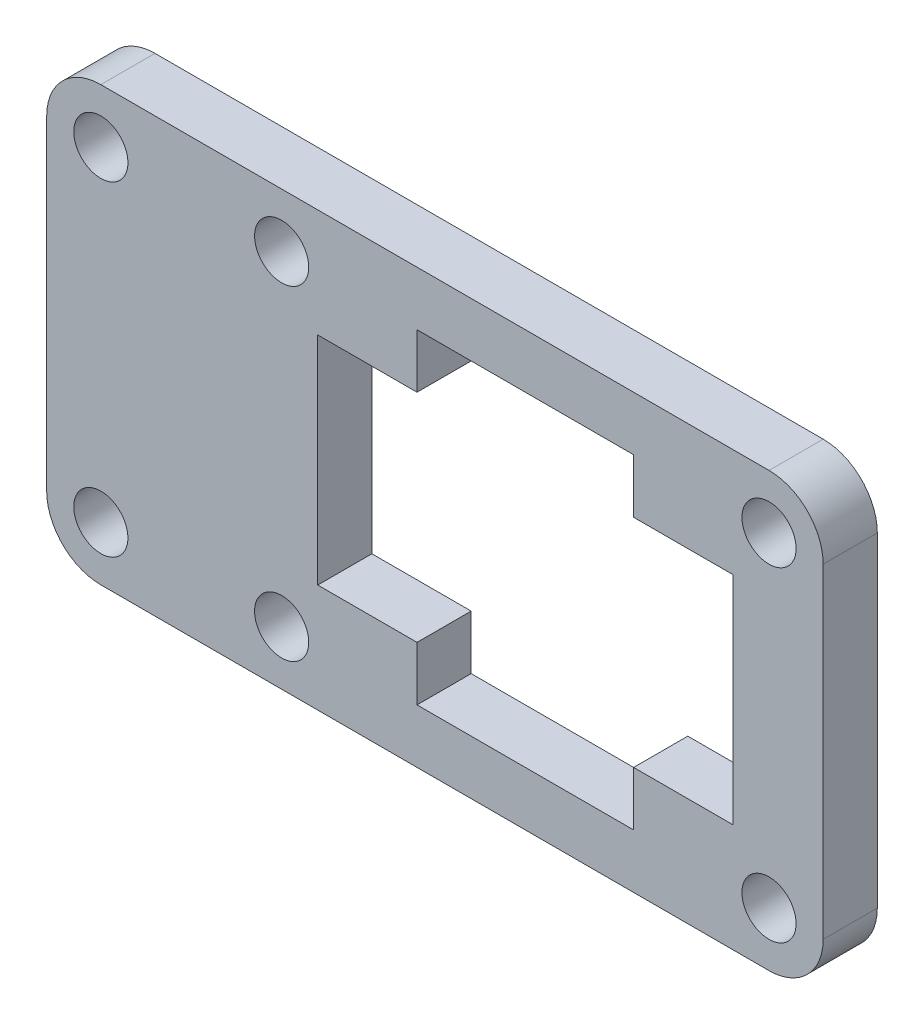
ISO-10303-21;
HEADER;
FILE_DESCRIPTION(('STEP AP214'),'2;1');
FILE_NAME('part.step','',(''),(''),'','','');
FILE_SCHEMA(('AUTOMOTIVE_DESIGN { 1 0 10303 214 1 1 1 1 }'));
ENDSEC;
DATA;
#1=APPLICATION_CONTEXT('core data for automotive mechanical design processes');
#2=APPLICATION_PROTOCOL_DEFINITION('international standard','automotive_design',2000,#1);
#3=PRODUCT_CONTEXT('',#1,'mechanical');
#4=PRODUCT('Part','Part','',(#3));
#5=PRODUCT_RELATED_PRODUCT_CATEGORY('part','',(#4));
#6=PRODUCT_DEFINITION_FORMATION('','',#4);
#7=PRODUCT_DEFINITION_CONTEXT('part definition',#1,'design');
#8=PRODUCT_DEFINITION('design','',#6,#7);
#9=PRODUCT_DEFINITION_SHAPE('','',#8);
#10=(LENGTH_UNIT() NAMED_UNIT(*) SI_UNIT(.MILLI.,.METRE.));
#11=(NAMED_UNIT(*) PLANE_ANGLE_UNIT() SI_UNIT($,.RADIAN.));
#12=(NAMED_UNIT(*) SI_UNIT($,.STERADIAN.) SOLID_ANGLE_UNIT());
#13=UNCERTAINTY_MEASURE_WITH_UNIT(LENGTH_MEASURE(1.E-05),#10,'distance_accuracy_value','');
#14=(GEOMETRIC_REPRESENTATION_CONTEXT(3) GLOBAL_UNCERTAINTY_ASSIGNED_CONTEXT((#13)) GLOBAL_UNIT_ASSIGNED_CONTEXT((#10,
#11,#12)) REPRESENTATION_CONTEXT('',''));
#15=CARTESIAN_POINT('',(0.,0.,0.));
#16=DIRECTION('',(0.,0.,1.));
#17=DIRECTION('',(1.,0.,0.));
#18=AXIS2_PLACEMENT_3D('',#15,#16,#17);
#19=CARTESIAN_POINT('',(63.748376395524,-38.3124718985925,3.));
#20=DIRECTION('',(0.,0.,-1.));
#21=DIRECTION('',(-1.,0.,0.));
#22=AXIS2_PLACEMENT_3D('',#19,#20,#21);
#23=PLANE('',#22);
#24=CARTESIAN_POINT('',(36.748376395524,-38.3124718985925,3.));
#25=DIRECTION('',(0.,0.,1.));
#26=DIRECTION('',(1.,0.,0.));
#27=AXIS2_PLACEMENT_3D('',#24,#25,#26);
#28=CIRCLE('',#27,1.5);
#29=CARTESIAN_POINT('',(38.248376395524,-38.3124718985925,3.));
#30=VERTEX_POINT('',#29);
#31=EDGE_CURVE('E469',#30,#30,#28,.T.);
#32=ORIENTED_EDGE('',*,*,#31,.F.);
#33=EDGE_LOOP('',(#32));
#34=FACE_BOUND('',#33,.T.);
#35=CARTESIAN_POINT('',(63.748376395524,-56.3124718985925,3.));
#36=DIRECTION('',(0.,0.,1.));
#37=DIRECTION('',(1.,0.,0.));
#38=AXIS2_PLACEMENT_3D('',#35,#36,#37);
#39=CIRCLE('',#38,1.5);
#40=CARTESIAN_POINT('',(65.248376395524,-56.3124718985925,3.));
#41=VERTEX_POINT('',#40);
#42=EDGE_CURVE('E481',#41,#41,#39,.T.);
#43=ORIENTED_EDGE('',*,*,#42,.F.);
#44=EDGE_LOOP('',(#43));
#45=FACE_BOUND('',#44,.T.);
#46=CARTESIAN_POINT('',(26.7321907696324,-38.3124718985925,3.));
#47=DIRECTION('',(0.,0.,1.));
#48=DIRECTION('',(1.,0.,0.));
#49=AXIS2_PLACEMENT_3D('',#46,#47,#48);
#50=CIRCLE('',#49,1.5);
#51=CARTESIAN_POINT('',(28.2321907696324,-38.3124718985925,3.));
#52=VERTEX_POINT('',#51);
#53=EDGE_CURVE('E220',#52,#52,#50,.T.);
#54=ORIENTED_EDGE('',*,*,#53,.F.);
#55=EDGE_LOOP('',(#54));
#56=FACE_BOUND('',#55,.T.);
#57=CARTESIAN_POINT('',(63.748376395524,-38.3124718985925,3.));
#58=DIRECTION('',(0.,0.,1.));
#59=DIRECTION('',(-1.,0.,0.));
#60=AXIS2_PLACEMENT_3D('',#57,#58,#59);
#61=CIRCLE('',#60,3.);
#62=CARTESIAN_POINT('',(66.748376395524,-38.3124718985925,3.));
#63=VERTEX_POINT('',#62);
#64=CARTESIAN_POINT('',(63.748376395524,-35.3124718985925,3.));
#65=VERTEX_POINT('',#64);
#66=EDGE_CURVE('E270',#63,#65,#61,.T.);
#67=ORIENTED_EDGE('',*,*,#66,.T.);
#68=DIRECTION('',(-1.,0.,0.));
#69=VECTOR('',#68,1.);
#70=CARTESIAN_POINT('',(26.7321907696324,-35.3124718985925,3.));
#71=LINE('',#70,#69);
#72=CARTESIAN_POINT('',(26.7321907696324,-35.3124718985925,3.));
#73=VERTEX_POINT('',#72);
#74=EDGE_CURVE('E273',#65,#73,#71,.T.);
#75=ORIENTED_EDGE('',*,*,#74,.T.);
#76=CARTESIAN_POINT('',(26.7321907696324,-38.3124718985925,3.));
#77=DIRECTION('',(0.,0.,1.));
#78=DIRECTION('',(1.,0.,0.));
#79=AXIS2_PLACEMENT_3D('',#76,#77,#78);
#80=CIRCLE('',#79,3.);
#81=CARTESIAN_POINT('',(23.7321907696324,-38.3124718985925,3.));
#82=VERTEX_POINT('',#81);
#83=EDGE_CURVE('E276',#73,#82,#80,.T.);
#84=ORIENTED_EDGE('',*,*,#83,.T.);
#85=DIRECTION('',(0.,-1.,0.));
#86=VECTOR('',#85,1.);
#87=CARTESIAN_POINT('',(23.7321907696324,-38.3124718985925,3.));
#88=LINE('',#87,#86);
#89=CARTESIAN_POINT('',(23.7321907696324,-56.3124718985925,3.));
#90=VERTEX_POINT('',#89);
#91=EDGE_CURVE('E278',#82,#90,#88,.T.);
#92=ORIENTED_EDGE('',*,*,#91,.T.);
#93=CARTESIAN_POINT('',(26.7321907696324,-56.3124718985925,3.));
#94=DIRECTION('',(0.,0.,1.));
#95=DIRECTION('',(1.,0.,0.));
#96=AXIS2_PLACEMENT_3D('',#93,#94,#95);
#97=CIRCLE('',#96,3.);
#98=CARTESIAN_POINT('',(26.7321907696324,-59.3124718985925,3.));
#99=VERTEX_POINT('',#98);
#100=EDGE_CURVE('E280',#90,#99,#97,.T.);
#101=ORIENTED_EDGE('',*,*,#100,.T.);
#102=DIRECTION('',(1.,0.,0.));
#103=VECTOR('',#102,1.);
#104=CARTESIAN_POINT('',(26.7321907696324,-59.3124718985925,3.));
#105=LINE('',#104,#103);
#106=CARTESIAN_POINT('',(63.748376395524,-59.3124718985925,3.));
#107=VERTEX_POINT('',#106);
#108=EDGE_CURVE('E282',#99,#107,#105,.T.);
#109=ORIENTED_EDGE('',*,*,#108,.T.);
#110=CARTESIAN_POINT('',(63.748376395524,-56.3124718985925,3.));
#111=DIRECTION('',(0.,0.,1.));
#112=DIRECTION('',(1.,0.,0.));
#113=AXIS2_PLACEMENT_3D('',#110,#111,#112);
#114=CIRCLE('',#113,3.);
#115=CARTESIAN_POINT('',(66.748376395524,-56.3124718985925,3.));
#116=VERTEX_POINT('',#115);
#117=EDGE_CURVE('E284',#107,#116,#114,.T.);
#118=ORIENTED_EDGE('',*,*,#117,.T.);
#119=DIRECTION('',(0.,1.,0.));
#120=VECTOR('',#119,1.);
#121=CARTESIAN_POINT('',(66.748376395524,-38.3124718985925,3.));
#122=LINE('',#121,#120);
#123=EDGE_CURVE('E286',#116,#63,#122,.T.);
#124=ORIENTED_EDGE('',*,*,#123,.T.);
#125=EDGE_LOOP('',(#67,#75,#84,#92,#101,#109,#118,#124));
#126=FACE_BOUND('',#125,.T.);
#127=DIRECTION('',(0.,-1.,0.));
#128=VECTOR('',#127,1.);
#129=CARTESIAN_POINT('',(38.748376395524,-53.3124718985925,3.));
#130=LINE('',#129,#128);
#131=CARTESIAN_POINT('',(38.748376395524,-41.3124718985925,3.));
#132=VERTEX_POINT('',#131);
#133=CARTESIAN_POINT('',(38.748376395524,-53.3124718985925,3.));
#134=VERTEX_POINT('',#133);
#135=EDGE_CURVE('E174',#132,#134,#130,.T.);
#136=ORIENTED_EDGE('',*,*,#135,.F.);
#137=DIRECTION('',(-1.,0.,0.));
#138=VECTOR('',#137,1.);
#139=CARTESIAN_POINT('',(38.748376395524,-41.3124718985925,3.));
#140=LINE('',#139,#138);
#141=CARTESIAN_POINT('',(44.248376395524,-41.3124718985925,3.));
#142=VERTEX_POINT('',#141);
#143=EDGE_CURVE('E217',#142,#132,#140,.T.);
#144=ORIENTED_EDGE('',*,*,#143,.F.);
#145=DIRECTION('',(0.,-1.,0.));
#146=VECTOR('',#145,1.);
#147=CARTESIAN_POINT('',(44.248376395524,-41.3124718985925,3.));
#148=LINE('',#147,#146);
#149=CARTESIAN_POINT('',(44.248376395524,-38.3124718985925,3.));
#150=VERTEX_POINT('',#149);
#151=EDGE_CURVE('E215',#150,#142,#148,.T.);
#152=ORIENTED_EDGE('',*,*,#151,.F.);
#153=DIRECTION('',(-1.,0.,0.));
#154=VECTOR('',#153,1.);
#155=CARTESIAN_POINT('',(56.248376395524,-38.3124718985925,3.));
#156=LINE('',#155,#154);
#157=CARTESIAN_POINT('',(56.248376395524,-38.3124718985925,3.));
#158=VERTEX_POINT('',#157);
#159=EDGE_CURVE('E213',#158,#150,#156,.T.);
#160=ORIENTED_EDGE('',*,*,#159,.F.);
#161=DIRECTION('',(0.,1.,0.));
#162=VECTOR('',#161,1.);
#163=CARTESIAN_POINT('',(56.248376395524,-41.3124718985925,3.));
#164=LINE('',#163,#162);
#165=CARTESIAN_POINT('',(56.248376395524,-41.3124718985925,3.));
#166=VERTEX_POINT('',#165);
#167=EDGE_CURVE('E211',#166,#158,#164,.T.);
#168=ORIENTED_EDGE('',*,*,#167,.F.);
#169=DIRECTION('',(-1.,0.,0.));
#170=VECTOR('',#169,1.);
#171=CARTESIAN_POINT('',(56.248376395524,-41.3124718985925,3.));
#172=LINE('',#171,#170);
#173=CARTESIAN_POINT('',(61.748376395524,-41.3124718985925,3.));
#174=VERTEX_POINT('',#173);
#175=EDGE_CURVE('E209',#174,#166,#172,.T.);
#176=ORIENTED_EDGE('',*,*,#175,.F.);
#177=DIRECTION('',(0.,1.,0.));
#178=VECTOR('',#177,1.);
#179=CARTESIAN_POINT('',(61.748376395524,-53.3124718985925,3.));
#180=LINE('',#179,#178);
#181=CARTESIAN_POINT('',(61.748376395524,-53.3124718985925,3.));
#182=VERTEX_POINT('',#181);
#183=EDGE_CURVE('E207',#182,#174,#180,.T.);
#184=ORIENTED_EDGE('',*,*,#183,.F.);
#185=DIRECTION('',(1.,0.,0.));
#186=VECTOR('',#185,1.);
#187=CARTESIAN_POINT('',(56.248376395524,-53.3124718985925,3.));
#188=LINE('',#187,#186);
#189=CARTESIAN_POINT('',(56.248376395524,-53.3124718985925,3.));
#190=VERTEX_POINT('',#189);
#191=EDGE_CURVE('E205',#190,#182,#188,.T.);
#192=ORIENTED_EDGE('',*,*,#191,.F.);
#193=DIRECTION('',(0.,1.,0.));
#194=VECTOR('',#193,1.);
#195=CARTESIAN_POINT('',(56.248376395524,-56.3124718985925,3.));
#196=LINE('',#195,#194);
#197=CARTESIAN_POINT('',(56.248376395524,-56.3124718985925,3.));
#198=VERTEX_POINT('',#197);
#199=EDGE_CURVE('E203',#198,#190,#196,.T.);
#200=ORIENTED_EDGE('',*,*,#199,.F.);
#201=DIRECTION('',(1.,0.,0.));
#202=VECTOR('',#201,1.);
#203=CARTESIAN_POINT('',(56.248376395524,-56.3124718985925,3.));
#204=LINE('',#203,#202);
#205=CARTESIAN_POINT('',(44.248376395524,-56.3124718985925,3.));
#206=VERTEX_POINT('',#205);
#207=EDGE_CURVE('E198',#206,#198,#204,.T.);
#208=ORIENTED_EDGE('',*,*,#207,.F.);
#209=DIRECTION('',(0.,-1.,0.));
#210=VECTOR('',#209,1.);
#211=CARTESIAN_POINT('',(44.248376395524,-56.3124718985925,3.));
#212=LINE('',#211,#210);
#213=CARTESIAN_POINT('',(44.248376395524,-53.3124718985925,3.));
#214=VERTEX_POINT('',#213);
#215=EDGE_CURVE('E196',#214,#206,#212,.T.);
#216=ORIENTED_EDGE('',*,*,#215,.F.);
#217=DIRECTION('',(1.,0.,0.));
#218=VECTOR('',#217,1.);
#219=CARTESIAN_POINT('',(38.748376395524,-53.3124718985925,3.));
#220=LINE('',#219,#218);
#221=EDGE_CURVE('E182',#134,#214,#220,.T.);
#222=ORIENTED_EDGE('',*,*,#221,.F.);
#223=EDGE_LOOP('',(#136,#144,#152,#160,#168,#176,#184,#192,#200,#208,#216,#222));
#224=FACE_BOUND('',#223,.T.);
#225=CARTESIAN_POINT('',(63.748376395524,-38.3124718985925,3.));
#226=DIRECTION('',(0.,0.,1.));
#227=DIRECTION('',(1.,0.,0.));
#228=AXIS2_PLACEMENT_3D('',#225,#226,#227);
#229=CIRCLE('',#228,1.5);
#230=CARTESIAN_POINT('',(65.248376395524,-38.3124718985925,3.));
#231=VERTEX_POINT('',#230);
#232=EDGE_CURVE('E487',#231,#231,#229,.T.);
#233=ORIENTED_EDGE('',*,*,#232,.F.);
#234=EDGE_LOOP('',(#233));
#235=FACE_BOUND('',#234,.T.);
#236=CARTESIAN_POINT('',(26.7321907696324,-56.3124718985925,3.));
#237=DIRECTION('',(0.,0.,1.));
#238=DIRECTION('',(1.,0.,0.));
#239=AXIS2_PLACEMENT_3D('',#236,#237,#238);
#240=CIRCLE('',#239,1.5);
#241=CARTESIAN_POINT('',(28.2321907696324,-56.3124718985925,3.));
#242=VERTEX_POINT('',#241);
#243=EDGE_CURVE('E475',#242,#242,#240,.T.);
#244=ORIENTED_EDGE('',*,*,#243,.F.);
#245=EDGE_LOOP('',(#244));
#246=FACE_BOUND('',#245,.T.);
#247=CARTESIAN_POINT('',(36.748376395524,-56.3124718985925,3.));
#248=DIRECTION('',(0.,0.,1.));
#249=DIRECTION('',(1.,0.,0.));
#250=AXIS2_PLACEMENT_3D('',#247,#248,#249);
#251=CIRCLE('',#250,1.5);
#252=CARTESIAN_POINT('',(38.248376395524,-56.3124718985925,3.));
#253=VERTEX_POINT('',#252);
#254=EDGE_CURVE('E460',#253,#253,#251,.T.);
#255=ORIENTED_EDGE('',*,*,#254,.F.);
#256=EDGE_LOOP('',(#255));
#257=FACE_BOUND('',#256,.T.);
#258=ADVANCED_FACE('F37',(#34,#45,#56,#126,#224,#235,#246,#257),#23,.F.);
#259=CARTESIAN_POINT('',(63.748376395524,-38.3124718985925,0.));
#260=DIRECTION('',(0.,0.,-1.));
#261=DIRECTION('',(-1.,0.,0.));
#262=AXIS2_PLACEMENT_3D('',#259,#260,#261);
#263=PLANE('',#262);
#264=CARTESIAN_POINT('',(36.748376395524,-38.3124718985925,0.));
#265=DIRECTION('',(0.,0.,1.));
#266=DIRECTION('',(1.,0.,0.));
#267=AXIS2_PLACEMENT_3D('',#264,#265,#266);
#268=CIRCLE('',#267,1.5);
#269=CARTESIAN_POINT('',(38.248376395524,-38.3124718985925,0.));
#270=VERTEX_POINT('',#269);
#271=EDGE_CURVE('E466',#270,#270,#268,.T.);
#272=ORIENTED_EDGE('',*,*,#271,.T.);
#273=EDGE_LOOP('',(#272));
#274=FACE_BOUND('',#273,.T.);
#275=CARTESIAN_POINT('',(63.748376395524,-56.3124718985925,0.));
#276=DIRECTION('',(0.,0.,1.));
#277=DIRECTION('',(1.,0.,0.));
#278=AXIS2_PLACEMENT_3D('',#275,#276,#277);
#279=CIRCLE('',#278,1.5);
#280=CARTESIAN_POINT('',(65.248376395524,-56.3124718985925,0.));
#281=VERTEX_POINT('',#280);
#282=EDGE_CURVE('E478',#281,#281,#279,.T.);
#283=ORIENTED_EDGE('',*,*,#282,.T.);
#284=EDGE_LOOP('',(#283));
#285=FACE_BOUND('',#284,.T.);
#286=CARTESIAN_POINT('',(26.7321907696324,-38.3124718985925,0.));
#287=DIRECTION('',(0.,0.,1.));
#288=DIRECTION('',(1.,0.,0.));
#289=AXIS2_PLACEMENT_3D('',#286,#287,#288);
#290=CIRCLE('',#289,1.5);
#291=CARTESIAN_POINT('',(28.2321907696324,-38.3124718985925,0.));
#292=VERTEX_POINT('',#291);
#293=EDGE_CURVE('E490',#292,#292,#290,.T.);
#294=ORIENTED_EDGE('',*,*,#293,.T.);
#295=EDGE_LOOP('',(#294));
#296=FACE_BOUND('',#295,.T.);
#297=CARTESIAN_POINT('',(63.748376395524,-38.3124718985925,0.));
#298=DIRECTION('',(0.,0.,1.));
#299=DIRECTION('',(-1.,0.,0.));
#300=AXIS2_PLACEMENT_3D('',#297,#298,#299);
#301=CIRCLE('',#300,3.);
#302=CARTESIAN_POINT('',(66.748376395524,-38.3124718985925,0.));
#303=VERTEX_POINT('',#302);
#304=CARTESIAN_POINT('',(63.748376395524,-35.3124718985925,0.));
#305=VERTEX_POINT('',#304);
#306=EDGE_CURVE('E190',#303,#305,#301,.T.);
#307=ORIENTED_EDGE('',*,*,#306,.F.);
#308=DIRECTION('',(0.,1.,0.));
#309=VECTOR('',#308,1.);
#310=CARTESIAN_POINT('',(66.748376395524,-38.3124718985925,0.));
#311=LINE('',#310,#309);
#312=CARTESIAN_POINT('',(66.748376395524,-56.3124718985925,0.));
#313=VERTEX_POINT('',#312);
#314=EDGE_CURVE('E274',#313,#303,#311,.T.);
#315=ORIENTED_EDGE('',*,*,#314,.F.);
#316=CARTESIAN_POINT('',(63.748376395524,-56.3124718985925,0.));
#317=DIRECTION('',(0.,0.,1.));
#318=DIRECTION('',(1.,0.,0.));
#319=AXIS2_PLACEMENT_3D('',#316,#317,#318);
#320=CIRCLE('',#319,3.);
#321=CARTESIAN_POINT('',(63.748376395524,-59.3124718985925,0.));
#322=VERTEX_POINT('',#321);
#323=EDGE_CURVE('E301',#322,#313,#320,.T.);
#324=ORIENTED_EDGE('',*,*,#323,.F.);
#325=DIRECTION('',(1.,0.,0.));
#326=VECTOR('',#325,1.);
#327=CARTESIAN_POINT('',(26.7321907696324,-59.3124718985925,0.));
#328=LINE('',#327,#326);
#329=CARTESIAN_POINT('',(26.7321907696324,-59.3124718985925,0.));
#330=VERTEX_POINT('',#329);
#331=EDGE_CURVE('E299',#330,#322,#328,.T.);
#332=ORIENTED_EDGE('',*,*,#331,.F.);
#333=CARTESIAN_POINT('',(26.7321907696324,-56.3124718985925,0.));
#334=DIRECTION('',(0.,0.,1.));
#335=DIRECTION('',(1.,0.,0.));
#336=AXIS2_PLACEMENT_3D('',#333,#334,#335);
#337=CIRCLE('',#336,3.);
#338=CARTESIAN_POINT('',(23.7321907696324,-56.3124718985925,0.));
#339=VERTEX_POINT('',#338);
#340=EDGE_CURVE('E297',#339,#330,#337,.T.);
#341=ORIENTED_EDGE('',*,*,#340,.F.);
#342=DIRECTION('',(0.,-1.,0.));
#343=VECTOR('',#342,1.);
#344=CARTESIAN_POINT('',(23.7321907696324,-38.3124718985925,0.));
#345=LINE('',#344,#343);
#346=CARTESIAN_POINT('',(23.7321907696324,-38.3124718985925,0.));
#347=VERTEX_POINT('',#346);
#348=EDGE_CURVE('E295',#347,#339,#345,.T.);
#349=ORIENTED_EDGE('',*,*,#348,.F.);
#350=CARTESIAN_POINT('',(26.7321907696324,-38.3124718985925,0.));
#351=DIRECTION('',(0.,0.,1.));
#352=DIRECTION('',(1.,0.,0.));
#353=AXIS2_PLACEMENT_3D('',#350,#351,#352);
#354=CIRCLE('',#353,3.);
#355=CARTESIAN_POINT('',(26.7321907696324,-35.3124718985925,0.));
#356=VERTEX_POINT('',#355);
#357=EDGE_CURVE('E293',#356,#347,#354,.T.);
#358=ORIENTED_EDGE('',*,*,#357,.F.);
#359=DIRECTION('',(-1.,0.,0.));
#360=VECTOR('',#359,1.);
#361=CARTESIAN_POINT('',(26.7321907696324,-35.3124718985925,0.));
#362=LINE('',#361,#360);
#363=EDGE_CURVE('E291',#305,#356,#362,.T.);
#364=ORIENTED_EDGE('',*,*,#363,.F.);
#365=EDGE_LOOP('',(#307,#315,#324,#332,#341,#349,#358,#364));
#366=FACE_BOUND('',#365,.T.);
#367=DIRECTION('',(-1.,0.,0.));
#368=VECTOR('',#367,1.);
#369=CARTESIAN_POINT('',(38.748376395524,-41.3124718985925,0.));
#370=LINE('',#369,#368);
#371=CARTESIAN_POINT('',(44.248376395524,-41.3124718985925,0.));
#372=VERTEX_POINT('',#371);
#373=CARTESIAN_POINT('',(38.748376395524,-41.3124718985925,0.));
#374=VERTEX_POINT('',#373);
#375=EDGE_CURVE('E183',#372,#374,#370,.T.);
#376=ORIENTED_EDGE('',*,*,#375,.T.);
#377=DIRECTION('',(0.,-1.,0.));
#378=VECTOR('',#377,1.);
#379=CARTESIAN_POINT('',(38.748376395524,-53.3124718985925,0.));
#380=LINE('',#379,#378);
#381=CARTESIAN_POINT('',(38.748376395524,-53.3124718985925,0.));
#382=VERTEX_POINT('',#381);
#383=EDGE_CURVE('E60',#374,#382,#380,.T.);
#384=ORIENTED_EDGE('',*,*,#383,.T.);
#385=DIRECTION('',(1.,0.,0.));
#386=VECTOR('',#385,1.);
#387=CARTESIAN_POINT('',(38.748376395524,-53.3124718985925,0.));
#388=LINE('',#387,#386);
#389=CARTESIAN_POINT('',(44.248376395524,-53.3124718985925,0.));
#390=VERTEX_POINT('',#389);
#391=EDGE_CURVE('E189',#382,#390,#388,.T.);
#392=ORIENTED_EDGE('',*,*,#391,.T.);
#393=DIRECTION('',(0.,-1.,0.));
#394=VECTOR('',#393,1.);
#395=CARTESIAN_POINT('',(44.248376395524,-56.3124718985925,0.));
#396=LINE('',#395,#394);
#397=CARTESIAN_POINT('',(44.248376395524,-56.3124718985925,0.));
#398=VERTEX_POINT('',#397);
#399=EDGE_CURVE('E222',#390,#398,#396,.T.);
#400=ORIENTED_EDGE('',*,*,#399,.T.);
#401=DIRECTION('',(1.,0.,0.));
#402=VECTOR('',#401,1.);
#403=CARTESIAN_POINT('',(56.248376395524,-56.3124718985925,0.));
#404=LINE('',#403,#402);
#405=CARTESIAN_POINT('',(56.248376395524,-56.3124718985925,0.));
#406=VERTEX_POINT('',#405);
#407=EDGE_CURVE('E225',#398,#406,#404,.T.);
#408=ORIENTED_EDGE('',*,*,#407,.T.);
#409=DIRECTION('',(0.,1.,0.));
#410=VECTOR('',#409,1.);
#411=CARTESIAN_POINT('',(56.248376395524,-56.3124718985925,0.));
#412=LINE('',#411,#410);
#413=CARTESIAN_POINT('',(56.248376395524,-53.3124718985925,0.));
#414=VERTEX_POINT('',#413);
#415=EDGE_CURVE('E228',#406,#414,#412,.T.);
#416=ORIENTED_EDGE('',*,*,#415,.T.);
#417=DIRECTION('',(1.,0.,0.));
#418=VECTOR('',#417,1.);
#419=CARTESIAN_POINT('',(56.248376395524,-53.3124718985925,0.));
#420=LINE('',#419,#418);
#421=CARTESIAN_POINT('',(61.748376395524,-53.3124718985925,0.));
#422=VERTEX_POINT('',#421);
#423=EDGE_CURVE('E231',#414,#422,#420,.T.);
#424=ORIENTED_EDGE('',*,*,#423,.T.);
#425=DIRECTION('',(0.,1.,0.));
#426=VECTOR('',#425,1.);
#427=CARTESIAN_POINT('',(61.748376395524,-53.3124718985925,0.));
#428=LINE('',#427,#426);
#429=CARTESIAN_POINT('',(61.748376395524,-41.3124718985925,0.));
#430=VERTEX_POINT('',#429);
#431=EDGE_CURVE('E234',#422,#430,#428,.T.);
#432=ORIENTED_EDGE('',*,*,#431,.T.);
#433=DIRECTION('',(-1.,0.,0.));
#434=VECTOR('',#433,1.);
#435=CARTESIAN_POINT('',(56.248376395524,-41.3124718985925,0.));
#436=LINE('',#435,#434);
#437=CARTESIAN_POINT('',(56.248376395524,-41.3124718985925,0.));
#438=VERTEX_POINT('',#437);
#439=EDGE_CURVE('E237',#430,#438,#436,.T.);
#440=ORIENTED_EDGE('',*,*,#439,.T.);
#441=DIRECTION('',(0.,1.,0.));
#442=VECTOR('',#441,1.);
#443=CARTESIAN_POINT('',(56.248376395524,-41.3124718985925,0.));
#444=LINE('',#443,#442);
#445=CARTESIAN_POINT('',(56.248376395524,-38.3124718985925,0.));
#446=VERTEX_POINT('',#445);
#447=EDGE_CURVE('E240',#438,#446,#444,.T.);
#448=ORIENTED_EDGE('',*,*,#447,.T.);
#449=DIRECTION('',(-1.,0.,0.));
#450=VECTOR('',#449,1.);
#451=CARTESIAN_POINT('',(56.248376395524,-38.3124718985925,0.));
#452=LINE('',#451,#450);
#453=CARTESIAN_POINT('',(44.248376395524,-38.3124718985925,0.));
#454=VERTEX_POINT('',#453);
#455=EDGE_CURVE('E243',#446,#454,#452,.T.);
#456=ORIENTED_EDGE('',*,*,#455,.T.);
#457=DIRECTION('',(0.,-1.,0.));
#458=VECTOR('',#457,1.);
#459=CARTESIAN_POINT('',(44.248376395524,-41.3124718985925,0.));
#460=LINE('',#459,#458);
#461=EDGE_CURVE('E246',#454,#372,#460,.T.);
#462=ORIENTED_EDGE('',*,*,#461,.T.);
#463=EDGE_LOOP('',(#376,#384,#392,#400,#408,#416,#424,#432,#440,#448,#456,#462));
#464=FACE_BOUND('',#463,.T.);
#465=CARTESIAN_POINT('',(63.748376395524,-38.3124718985925,0.));
#466=DIRECTION('',(0.,0.,1.));
#467=DIRECTION('',(1.,0.,0.));
#468=AXIS2_PLACEMENT_3D('',#465,#466,#467);
#469=CIRCLE('',#468,1.5);
#470=CARTESIAN_POINT('',(65.248376395524,-38.3124718985925,0.));
#471=VERTEX_POINT('',#470);
#472=EDGE_CURVE('E484',#471,#471,#469,.T.);
#473=ORIENTED_EDGE('',*,*,#472,.T.);
#474=EDGE_LOOP('',(#473));
#475=FACE_BOUND('',#474,.T.);
#476=CARTESIAN_POINT('',(26.7321907696324,-56.3124718985925,0.));
#477=DIRECTION('',(0.,0.,1.));
#478=DIRECTION('',(1.,0.,0.));
#479=AXIS2_PLACEMENT_3D('',#476,#477,#478);
#480=CIRCLE('',#479,1.5);
#481=CARTESIAN_POINT('',(28.2321907696324,-56.3124718985925,0.));
#482=VERTEX_POINT('',#481);
#483=EDGE_CURVE('E472',#482,#482,#480,.T.);
#484=ORIENTED_EDGE('',*,*,#483,.T.);
#485=EDGE_LOOP('',(#484));
#486=FACE_BOUND('',#485,.T.);
#487=CARTESIAN_POINT('',(36.748376395524,-56.3124718985925,0.));
#488=DIRECTION('',(0.,0.,1.));
#489=DIRECTION('',(1.,0.,0.));
#490=AXIS2_PLACEMENT_3D('',#487,#488,#489);
#491=CIRCLE('',#490,1.5);
#492=CARTESIAN_POINT('',(38.248376395524,-56.3124718985925,0.));
#493=VERTEX_POINT('',#492);
#494=EDGE_CURVE('E463',#493,#493,#491,.T.);
#495=ORIENTED_EDGE('',*,*,#494,.T.);
#496=EDGE_LOOP('',(#495));
#497=FACE_BOUND('',#496,.T.);
#498=ADVANCED_FACE('F331',(#274,#285,#296,#366,#464,#475,#486,#497),#263,.T.);
#499=CARTESIAN_POINT('',(63.748376395524,-38.3124718985925,3.));
#500=DIRECTION('',(0.,0.,-1.));
#501=DIRECTION('',(-1.,0.,0.));
#502=AXIS2_PLACEMENT_3D('',#499,#500,#501);
#503=CYLINDRICAL_SURFACE('',#502,3.);
#504=ORIENTED_EDGE('',*,*,#306,.T.);
#505=DIRECTION('',(0.,0.,-1.));
#506=VECTOR('',#505,1.);
#507=CARTESIAN_POINT('',(63.748376395524,-35.3124718985925,3.));
#508=LINE('',#507,#506);
#509=EDGE_CURVE('E11',#65,#305,#508,.T.);
#510=ORIENTED_EDGE('',*,*,#509,.F.);
#511=ORIENTED_EDGE('',*,*,#66,.F.);
#512=DIRECTION('',(0.,0.,-1.));
#513=VECTOR('',#512,1.);
#514=CARTESIAN_POINT('',(66.748376395524,-38.3124718985925,3.));
#515=LINE('',#514,#513);
#516=EDGE_CURVE('E288',#63,#303,#515,.T.);
#517=ORIENTED_EDGE('',*,*,#516,.T.);
#518=EDGE_LOOP('',(#504,#510,#511,#517));
#519=FACE_BOUND('',#518,.T.);
#520=ADVANCED_FACE('F39',(#519),#503,.T.);
#521=CARTESIAN_POINT('',(26.7321907696324,-35.3124718985925,3.));
#522=DIRECTION('',(0.,-1.,0.));
#523=DIRECTION('',(0.,0.,-1.));
#524=AXIS2_PLACEMENT_3D('',#521,#522,#523);
#525=PLANE('',#524);
#526=ORIENTED_EDGE('',*,*,#363,.T.);
#527=DIRECTION('',(0.,0.,-1.));
#528=VECTOR('',#527,1.);
#529=CARTESIAN_POINT('',(26.7321907696324,-35.3124718985925,3.));
#530=LINE('',#529,#528);
#531=EDGE_CURVE('E45',#73,#356,#530,.T.);
#532=ORIENTED_EDGE('',*,*,#531,.F.);
#533=ORIENTED_EDGE('',*,*,#74,.F.);
#534=ORIENTED_EDGE('',*,*,#509,.T.);
#535=EDGE_LOOP('',(#526,#532,#533,#534));
#536=FACE_BOUND('',#535,.T.);
#537=ADVANCED_FACE('F348',(#536),#525,.F.);
#538=CARTESIAN_POINT('',(26.7321907696324,-38.3124718985925,3.));
#539=DIRECTION('',(0.,0.,-1.));
#540=DIRECTION('',(-1.,0.,0.));
#541=AXIS2_PLACEMENT_3D('',#538,#539,#540);
#542=CYLINDRICAL_SURFACE('',#541,3.);
#543=ORIENTED_EDGE('',*,*,#357,.T.);
#544=DIRECTION('',(0.,0.,-1.));
#545=VECTOR('',#544,1.);
#546=CARTESIAN_POINT('',(23.7321907696324,-38.3124718985925,3.));
#547=LINE('',#546,#545);
#548=EDGE_CURVE('E318',#82,#347,#547,.T.);
#549=ORIENTED_EDGE('',*,*,#548,.F.);
#550=ORIENTED_EDGE('',*,*,#83,.F.);
#551=ORIENTED_EDGE('',*,*,#531,.T.);
#552=EDGE_LOOP('',(#543,#549,#550,#551));
#553=FACE_BOUND('',#552,.T.);
#554=ADVANCED_FACE('F325',(#553),#542,.T.);
#555=CARTESIAN_POINT('',(23.7321907696324,-38.3124718985925,3.));
#556=DIRECTION('',(1.,0.,0.));
#557=DIRECTION('',(0.,1.,0.));
#558=AXIS2_PLACEMENT_3D('',#555,#556,#557);
#559=PLANE('',#558);
#560=ORIENTED_EDGE('',*,*,#348,.T.);
#561=DIRECTION('',(0.,0.,-1.));
#562=VECTOR('',#561,1.);
#563=CARTESIAN_POINT('',(23.7321907696324,-56.3124718985925,3.));
#564=LINE('',#563,#562);
#565=EDGE_CURVE('E315',#90,#339,#564,.T.);
#566=ORIENTED_EDGE('',*,*,#565,.F.);
#567=ORIENTED_EDGE('',*,*,#91,.F.);
#568=ORIENTED_EDGE('',*,*,#548,.T.);
#569=EDGE_LOOP('',(#560,#566,#567,#568));
#570=FACE_BOUND('',#569,.T.);
#571=ADVANCED_FACE('F337',(#570),#559,.F.);
#572=CARTESIAN_POINT('',(26.7321907696324,-56.3124718985925,3.));
#573=DIRECTION('',(0.,0.,-1.));
#574=DIRECTION('',(-1.,0.,0.));
#575=AXIS2_PLACEMENT_3D('',#572,#573,#574);
#576=CYLINDRICAL_SURFACE('',#575,3.);
#577=ORIENTED_EDGE('',*,*,#340,.T.);
#578=DIRECTION('',(0.,0.,-1.));
#579=VECTOR('',#578,1.);
#580=CARTESIAN_POINT('',(26.7321907696324,-59.3124718985925,3.));
#581=LINE('',#580,#579);
#582=EDGE_CURVE('E312',#99,#330,#581,.T.);
#583=ORIENTED_EDGE('',*,*,#582,.F.);
#584=ORIENTED_EDGE('',*,*,#100,.F.);
#585=ORIENTED_EDGE('',*,*,#565,.T.);
#586=EDGE_LOOP('',(#577,#583,#584,#585));
#587=FACE_BOUND('',#586,.T.);
#588=ADVANCED_FACE('F341',(#587),#576,.T.);
#589=CARTESIAN_POINT('',(26.7321907696324,-59.3124718985925,3.));
#590=DIRECTION('',(0.,1.,0.));
#591=DIRECTION('',(0.,0.,1.));
#592=AXIS2_PLACEMENT_3D('',#589,#590,#591);
#593=PLANE('',#592);
#594=ORIENTED_EDGE('',*,*,#331,.T.);
#595=DIRECTION('',(0.,0.,-1.));
#596=VECTOR('',#595,1.);
#597=CARTESIAN_POINT('',(63.748376395524,-59.3124718985925,3.));
#598=LINE('',#597,#596);
#599=EDGE_CURVE('E309',#107,#322,#598,.T.);
#600=ORIENTED_EDGE('',*,*,#599,.F.);
#601=ORIENTED_EDGE('',*,*,#108,.F.);
#602=ORIENTED_EDGE('',*,*,#582,.T.);
#603=EDGE_LOOP('',(#594,#600,#601,#602));
#604=FACE_BOUND('',#603,.T.);
#605=ADVANCED_FACE('F361',(#604),#593,.F.);
#606=CARTESIAN_POINT('',(63.748376395524,-56.3124718985925,3.));
#607=DIRECTION('',(0.,0.,-1.));
#608=DIRECTION('',(-1.,0.,0.));
#609=AXIS2_PLACEMENT_3D('',#606,#607,#608);
#610=CYLINDRICAL_SURFACE('',#609,3.);
#611=ORIENTED_EDGE('',*,*,#323,.T.);
#612=DIRECTION('',(0.,0.,-1.));
#613=VECTOR('',#612,1.);
#614=CARTESIAN_POINT('',(66.748376395524,-56.3124718985925,3.));
#615=LINE('',#614,#613);
#616=EDGE_CURVE('E306',#116,#313,#615,.T.);
#617=ORIENTED_EDGE('',*,*,#616,.F.);
#618=ORIENTED_EDGE('',*,*,#117,.F.);
#619=ORIENTED_EDGE('',*,*,#599,.T.);
#620=EDGE_LOOP('',(#611,#617,#618,#619));
#621=FACE_BOUND('',#620,.T.);
#622=ADVANCED_FACE('F359',(#621),#610,.T.);
#623=CARTESIAN_POINT('',(66.748376395524,-38.3124718985925,3.));
#624=DIRECTION('',(-1.,0.,0.));
#625=DIRECTION('',(0.,-1.,0.));
#626=AXIS2_PLACEMENT_3D('',#623,#624,#625);
#627=PLANE('',#626);
#628=ORIENTED_EDGE('',*,*,#314,.T.);
#629=ORIENTED_EDGE('',*,*,#516,.F.);
#630=ORIENTED_EDGE('',*,*,#123,.F.);
#631=ORIENTED_EDGE('',*,*,#616,.T.);
#632=EDGE_LOOP('',(#628,#629,#630,#631));
#633=FACE_BOUND('',#632,.T.);
#634=ADVANCED_FACE('F354',(#633),#627,.F.);
#635=CARTESIAN_POINT('',(38.748376395524,-53.3124718985925,3.));
#636=DIRECTION('',(1.,0.,0.));
#637=DIRECTION('',(0.,1.,0.));
#638=AXIS2_PLACEMENT_3D('',#635,#636,#637);
#639=PLANE('',#638);
#640=ORIENTED_EDGE('',*,*,#383,.F.);
#641=DIRECTION('',(0.,0.,-1.));
#642=VECTOR('',#641,1.);
#643=CARTESIAN_POINT('',(38.748376395524,-41.3124718985925,3.));
#644=LINE('',#643,#642);
#645=EDGE_CURVE('E178',#132,#374,#644,.T.);
#646=ORIENTED_EDGE('',*,*,#645,.F.);
#647=ORIENTED_EDGE('',*,*,#135,.T.);
#648=DIRECTION('',(0.,0.,-1.));
#649=VECTOR('',#648,1.);
#650=CARTESIAN_POINT('',(38.748376395524,-53.3124718985925,3.));
#651=LINE('',#650,#649);
#652=EDGE_CURVE('E177',#134,#382,#651,.T.);
#653=ORIENTED_EDGE('',*,*,#652,.T.);
#654=EDGE_LOOP('',(#640,#646,#647,#653));
#655=FACE_BOUND('',#654,.T.);
#656=ADVANCED_FACE('F176',(#655),#639,.T.);
#657=CARTESIAN_POINT('',(38.748376395524,-53.3124718985925,3.));
#658=DIRECTION('',(0.,1.,0.));
#659=DIRECTION('',(0.,0.,1.));
#660=AXIS2_PLACEMENT_3D('',#657,#658,#659);
#661=PLANE('',#660);
#662=ORIENTED_EDGE('',*,*,#391,.F.);
#663=ORIENTED_EDGE('',*,*,#652,.F.);
#664=ORIENTED_EDGE('',*,*,#221,.T.);
#665=DIRECTION('',(0.,0.,-1.));
#666=VECTOR('',#665,1.);
#667=CARTESIAN_POINT('',(44.248376395524,-53.3124718985925,3.));
#668=LINE('',#667,#666);
#669=EDGE_CURVE('E191',#214,#390,#668,.T.);
#670=ORIENTED_EDGE('',*,*,#669,.T.);
#671=EDGE_LOOP('',(#662,#663,#664,#670));
#672=FACE_BOUND('',#671,.T.);
#673=ADVANCED_FACE('F186',(#672),#661,.T.);
#674=CARTESIAN_POINT('',(44.248376395524,-56.3124718985925,3.));
#675=DIRECTION('',(1.,0.,0.));
#676=DIRECTION('',(0.,0.,-1.));
#677=AXIS2_PLACEMENT_3D('',#674,#675,#676);
#678=PLANE('',#677);
#679=ORIENTED_EDGE('',*,*,#399,.F.);
#680=ORIENTED_EDGE('',*,*,#669,.F.);
#681=ORIENTED_EDGE('',*,*,#215,.T.);
#682=DIRECTION('',(0.,0.,-1.));
#683=VECTOR('',#682,1.);
#684=CARTESIAN_POINT('',(44.248376395524,-56.3124718985925,3.));
#685=LINE('',#684,#683);
#686=EDGE_CURVE('E267',#206,#398,#685,.T.);
#687=ORIENTED_EDGE('',*,*,#686,.T.);
#688=EDGE_LOOP('',(#679,#680,#681,#687));
#689=FACE_BOUND('',#688,.T.);
#690=ADVANCED_FACE('F390',(#689),#678,.T.);
#691=CARTESIAN_POINT('',(56.248376395524,-56.3124718985925,3.));
#692=DIRECTION('',(0.,1.,0.));
#693=DIRECTION('',(0.,0.,1.));
#694=AXIS2_PLACEMENT_3D('',#691,#692,#693);
#695=PLANE('',#694);
#696=ORIENTED_EDGE('',*,*,#407,.F.);
#697=ORIENTED_EDGE('',*,*,#686,.F.);
#698=ORIENTED_EDGE('',*,*,#207,.T.);
#699=DIRECTION('',(0.,0.,-1.));
#700=VECTOR('',#699,1.);
#701=CARTESIAN_POINT('',(56.248376395524,-56.3124718985925,3.));
#702=LINE('',#701,#700);
#703=EDGE_CURVE('E265',#198,#406,#702,.T.);
#704=ORIENTED_EDGE('',*,*,#703,.T.);
#705=EDGE_LOOP('',(#696,#697,#698,#704));
#706=FACE_BOUND('',#705,.T.);
#707=ADVANCED_FACE('F394',(#706),#695,.T.);
#708=CARTESIAN_POINT('',(56.248376395524,-56.3124718985925,3.));
#709=DIRECTION('',(-1.,0.,0.));
#710=DIRECTION('',(0.,0.,1.));
#711=AXIS2_PLACEMENT_3D('',#708,#709,#710);
#712=PLANE('',#711);
#713=ORIENTED_EDGE('',*,*,#415,.F.);
#714=ORIENTED_EDGE('',*,*,#703,.F.);
#715=ORIENTED_EDGE('',*,*,#199,.T.);
#716=DIRECTION('',(0.,0.,-1.));
#717=VECTOR('',#716,1.);
#718=CARTESIAN_POINT('',(56.248376395524,-53.3124718985925,3.));
#719=LINE('',#718,#717);
#720=EDGE_CURVE('E263',#190,#414,#719,.T.);
#721=ORIENTED_EDGE('',*,*,#720,.T.);
#722=EDGE_LOOP('',(#713,#714,#715,#721));
#723=FACE_BOUND('',#722,.T.);
#724=ADVANCED_FACE('F400',(#723),#712,.T.);
#725=CARTESIAN_POINT('',(56.248376395524,-53.3124718985925,3.));
#726=DIRECTION('',(0.,1.,0.));
#727=DIRECTION('',(0.,0.,1.));
#728=AXIS2_PLACEMENT_3D('',#725,#726,#727);
#729=PLANE('',#728);
#730=ORIENTED_EDGE('',*,*,#423,.F.);
#731=ORIENTED_EDGE('',*,*,#720,.F.);
#732=ORIENTED_EDGE('',*,*,#191,.T.);
#733=DIRECTION('',(0.,0.,-1.));
#734=VECTOR('',#733,1.);
#735=CARTESIAN_POINT('',(61.748376395524,-53.3124718985925,3.));
#736=LINE('',#735,#734);
#737=EDGE_CURVE('E261',#182,#422,#736,.T.);
#738=ORIENTED_EDGE('',*,*,#737,.T.);
#739=EDGE_LOOP('',(#730,#731,#732,#738));
#740=FACE_BOUND('',#739,.T.);
#741=ADVANCED_FACE('F404',(#740),#729,.T.);
#742=CARTESIAN_POINT('',(61.748376395524,-53.3124718985925,3.));
#743=DIRECTION('',(-1.,0.,0.));
#744=DIRECTION('',(0.,-1.,0.));
#745=AXIS2_PLACEMENT_3D('',#742,#743,#744);
#746=PLANE('',#745);
#747=ORIENTED_EDGE('',*,*,#431,.F.);
#748=ORIENTED_EDGE('',*,*,#737,.F.);
#749=ORIENTED_EDGE('',*,*,#183,.T.);
#750=DIRECTION('',(0.,0.,-1.));
#751=VECTOR('',#750,1.);
#752=CARTESIAN_POINT('',(61.748376395524,-41.3124718985925,3.));
#753=LINE('',#752,#751);
#754=EDGE_CURVE('E259',#174,#430,#753,.T.);
#755=ORIENTED_EDGE('',*,*,#754,.T.);
#756=EDGE_LOOP('',(#747,#748,#749,#755));
#757=FACE_BOUND('',#756,.T.);
#758=ADVANCED_FACE('F408',(#757),#746,.T.);
#759=CARTESIAN_POINT('',(56.248376395524,-41.3124718985925,3.));
#760=DIRECTION('',(0.,-1.,0.));
#761=DIRECTION('',(0.,0.,-1.));
#762=AXIS2_PLACEMENT_3D('',#759,#760,#761);
#763=PLANE('',#762);
#764=ORIENTED_EDGE('',*,*,#439,.F.);
#765=ORIENTED_EDGE('',*,*,#754,.F.);
#766=ORIENTED_EDGE('',*,*,#175,.T.);
#767=DIRECTION('',(0.,0.,-1.));
#768=VECTOR('',#767,1.);
#769=CARTESIAN_POINT('',(56.248376395524,-41.3124718985925,3.));
#770=LINE('',#769,#768);
#771=EDGE_CURVE('E257',#166,#438,#770,.T.);
#772=ORIENTED_EDGE('',*,*,#771,.T.);
#773=EDGE_LOOP('',(#764,#765,#766,#772));
#774=FACE_BOUND('',#773,.T.);
#775=ADVANCED_FACE('F412',(#774),#763,.T.);
#776=CARTESIAN_POINT('',(56.248376395524,-41.3124718985925,3.));
#777=DIRECTION('',(-1.,0.,0.));
#778=DIRECTION('',(0.,0.,1.));
#779=AXIS2_PLACEMENT_3D('',#776,#777,#778);
#780=PLANE('',#779);
#781=ORIENTED_EDGE('',*,*,#447,.F.);
#782=ORIENTED_EDGE('',*,*,#771,.F.);
#783=ORIENTED_EDGE('',*,*,#167,.T.);
#784=DIRECTION('',(0.,0.,-1.));
#785=VECTOR('',#784,1.);
#786=CARTESIAN_POINT('',(56.248376395524,-38.3124718985925,3.));
#787=LINE('',#786,#785);
#788=EDGE_CURVE('E255',#158,#446,#787,.T.);
#789=ORIENTED_EDGE('',*,*,#788,.T.);
#790=EDGE_LOOP('',(#781,#782,#783,#789));
#791=FACE_BOUND('',#790,.T.);
#792=ADVANCED_FACE('F416',(#791),#780,.T.);
#793=CARTESIAN_POINT('',(56.248376395524,-38.3124718985925,3.));
#794=DIRECTION('',(0.,-1.,0.));
#795=DIRECTION('',(0.,0.,-1.));
#796=AXIS2_PLACEMENT_3D('',#793,#794,#795);
#797=PLANE('',#796);
#798=ORIENTED_EDGE('',*,*,#455,.F.);
#799=ORIENTED_EDGE('',*,*,#788,.F.);
#800=ORIENTED_EDGE('',*,*,#159,.T.);
#801=DIRECTION('',(0.,0.,-1.));
#802=VECTOR('',#801,1.);
#803=CARTESIAN_POINT('',(44.248376395524,-38.3124718985925,3.));
#804=LINE('',#803,#802);
#805=EDGE_CURVE('E253',#150,#454,#804,.T.);
#806=ORIENTED_EDGE('',*,*,#805,.T.);
#807=EDGE_LOOP('',(#798,#799,#800,#806));
#808=FACE_BOUND('',#807,.T.);
#809=ADVANCED_FACE('F420',(#808),#797,.T.);
#810=CARTESIAN_POINT('',(44.248376395524,-41.3124718985925,3.));
#811=DIRECTION('',(1.,0.,0.));
#812=DIRECTION('',(0.,0.,-1.));
#813=AXIS2_PLACEMENT_3D('',#810,#811,#812);
#814=PLANE('',#813);
#815=ORIENTED_EDGE('',*,*,#461,.F.);
#816=ORIENTED_EDGE('',*,*,#805,.F.);
#817=ORIENTED_EDGE('',*,*,#151,.T.);
#818=DIRECTION('',(0.,0.,-1.));
#819=VECTOR('',#818,1.);
#820=CARTESIAN_POINT('',(44.248376395524,-41.3124718985925,3.));
#821=LINE('',#820,#819);
#822=EDGE_CURVE('E52',#142,#372,#821,.T.);
#823=ORIENTED_EDGE('',*,*,#822,.T.);
#824=EDGE_LOOP('',(#815,#816,#817,#823));
#825=FACE_BOUND('',#824,.T.);
#826=ADVANCED_FACE('F424',(#825),#814,.T.);
#827=CARTESIAN_POINT('',(38.748376395524,-41.3124718985925,3.));
#828=DIRECTION('',(0.,-1.,0.));
#829=DIRECTION('',(0.,0.,-1.));
#830=AXIS2_PLACEMENT_3D('',#827,#828,#829);
#831=PLANE('',#830);
#832=ORIENTED_EDGE('',*,*,#375,.F.);
#833=ORIENTED_EDGE('',*,*,#822,.F.);
#834=ORIENTED_EDGE('',*,*,#143,.T.);
#835=ORIENTED_EDGE('',*,*,#645,.T.);
#836=EDGE_LOOP('',(#832,#833,#834,#835));
#837=FACE_BOUND('',#836,.T.);
#838=ADVANCED_FACE('F428',(#837),#831,.T.);
#839=CARTESIAN_POINT('',(26.7321907696324,-38.3124718985925,3.));
#840=DIRECTION('',(0.,0.,-1.));
#841=DIRECTION('',(-1.,0.,0.));
#842=AXIS2_PLACEMENT_3D('',#839,#840,#841);
#843=CYLINDRICAL_SURFACE('',#842,1.5);
#844=ORIENTED_EDGE('',*,*,#53,.T.);
#845=EDGE_LOOP('',(#844));
#846=FACE_BOUND('',#845,.T.);
#847=ORIENTED_EDGE('',*,*,#293,.F.);
#848=EDGE_LOOP('',(#847));
#849=FACE_BOUND('',#848,.T.);
#850=ADVANCED_FACE('F432',(#846,#849),#843,.F.);
#851=CARTESIAN_POINT('',(63.748376395524,-38.3124718985925,3.));
#852=DIRECTION('',(0.,0.,-1.));
#853=DIRECTION('',(-1.,0.,0.));
#854=AXIS2_PLACEMENT_3D('',#851,#852,#853);
#855=CYLINDRICAL_SURFACE('',#854,1.5);
#856=ORIENTED_EDGE('',*,*,#232,.T.);
#857=EDGE_LOOP('',(#856));
#858=FACE_BOUND('',#857,.T.);
#859=ORIENTED_EDGE('',*,*,#472,.F.);
#860=EDGE_LOOP('',(#859));
#861=FACE_BOUND('',#860,.T.);
#862=ADVANCED_FACE('F435',(#858,#861),#855,.F.);
#863=CARTESIAN_POINT('',(63.748376395524,-56.3124718985925,3.));
#864=DIRECTION('',(0.,0.,-1.));
#865=DIRECTION('',(-1.,0.,0.));
#866=AXIS2_PLACEMENT_3D('',#863,#864,#865);
#867=CYLINDRICAL_SURFACE('',#866,1.5);
#868=ORIENTED_EDGE('',*,*,#42,.T.);
#869=EDGE_LOOP('',(#868));
#870=FACE_BOUND('',#869,.T.);
#871=ORIENTED_EDGE('',*,*,#282,.F.);
#872=EDGE_LOOP('',(#871));
#873=FACE_BOUND('',#872,.T.);
#874=ADVANCED_FACE('F439',(#870,#873),#867,.F.);
#875=CARTESIAN_POINT('',(26.7321907696324,-56.3124718985925,3.));
#876=DIRECTION('',(0.,0.,-1.));
#877=DIRECTION('',(-1.,0.,0.));
#878=AXIS2_PLACEMENT_3D('',#875,#876,#877);
#879=CYLINDRICAL_SURFACE('',#878,1.5);
#880=ORIENTED_EDGE('',*,*,#243,.T.);
#881=EDGE_LOOP('',(#880));
#882=FACE_BOUND('',#881,.T.);
#883=ORIENTED_EDGE('',*,*,#483,.F.);
#884=EDGE_LOOP('',(#883));
#885=FACE_BOUND('',#884,.T.);
#886=ADVANCED_FACE('F443',(#882,#885),#879,.F.);
#887=CARTESIAN_POINT('',(36.748376395524,-38.3124718985925,3.));
#888=DIRECTION('',(0.,0.,-1.));
#889=DIRECTION('',(-1.,0.,0.));
#890=AXIS2_PLACEMENT_3D('',#887,#888,#889);
#891=CYLINDRICAL_SURFACE('',#890,1.5);
#892=ORIENTED_EDGE('',*,*,#31,.T.);
#893=EDGE_LOOP('',(#892));
#894=FACE_BOUND('',#893,.T.);
#895=ORIENTED_EDGE('',*,*,#271,.F.);
#896=EDGE_LOOP('',(#895));
#897=FACE_BOUND('',#896,.T.);
#898=ADVANCED_FACE('F447',(#894,#897),#891,.F.);
#899=CARTESIAN_POINT('',(36.748376395524,-56.3124718985925,3.));
#900=DIRECTION('',(0.,0.,-1.));
#901=DIRECTION('',(-1.,0.,0.));
#902=AXIS2_PLACEMENT_3D('',#899,#900,#901);
#903=CYLINDRICAL_SURFACE('',#902,1.5);
#904=ORIENTED_EDGE('',*,*,#254,.T.);
#905=EDGE_LOOP('',(#904));
#906=FACE_BOUND('',#905,.T.);
#907=ORIENTED_EDGE('',*,*,#494,.F.);
#908=EDGE_LOOP('',(#907));
#909=FACE_BOUND('',#908,.T.);
#910=ADVANCED_FACE('F451',(#906,#909),#903,.F.);
#911=CLOSED_SHELL('',(#258,#498,#520,#537,#554,#571,#588,#605,#622,#634,#656,#673,#690,#707,
#724,#741,#758,#775,#792,#809,#826,#838,#850,#862,#874,#886,#898,#910));
#912=MANIFOLD_SOLID_BREP('B2',#911);
#913=ADVANCED_BREP_SHAPE_REPRESENTATION('',(#18,#912),#14);
#914=SHAPE_DEFINITION_REPRESENTATION(#9,#913);
ENDSEC;
END-ISO-10303-21;
